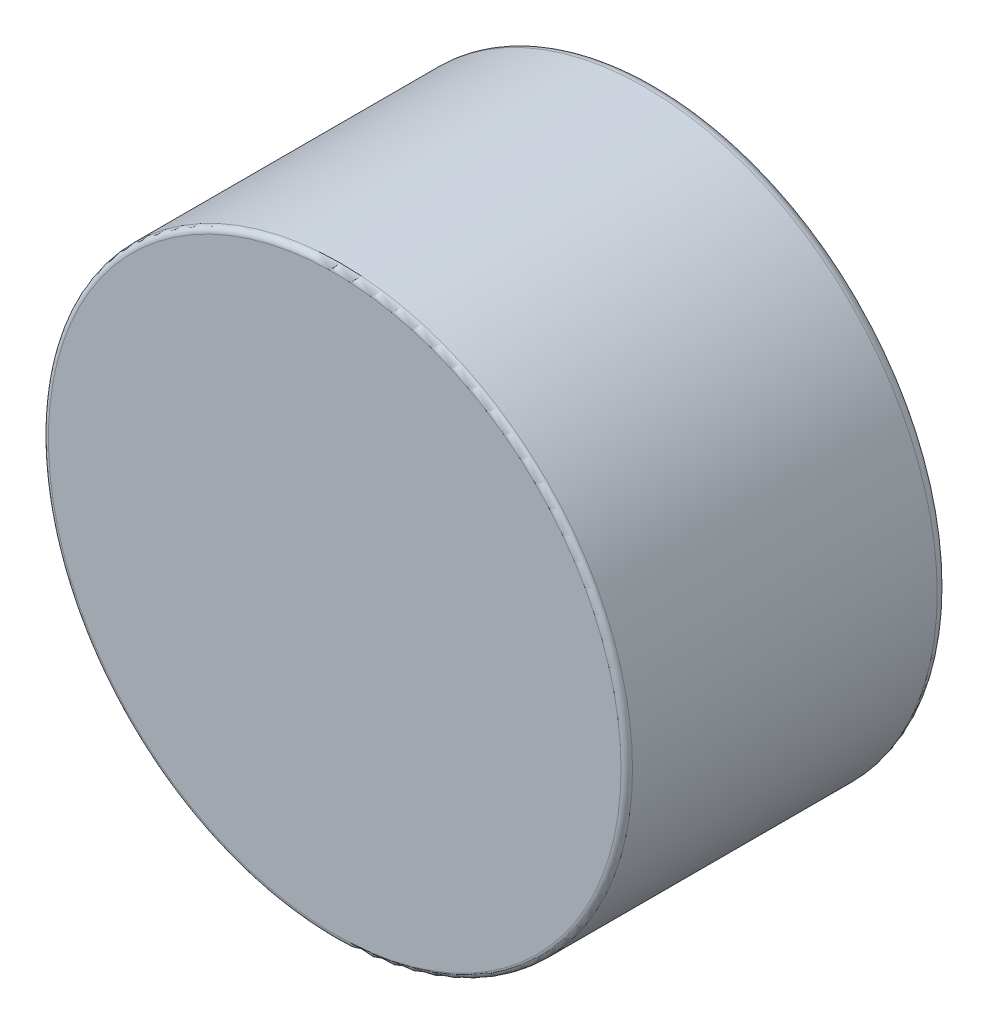
ISO-10303-21;
HEADER;
FILE_DESCRIPTION(('STEP AP214'),'2;1');
FILE_NAME('part.step','',(''),(''),'','','');
FILE_SCHEMA(('AUTOMOTIVE_DESIGN { 1 0 10303 214 1 1 1 1 }'));
ENDSEC;
DATA;
#1=APPLICATION_CONTEXT('core data for automotive mechanical design processes');
#2=APPLICATION_PROTOCOL_DEFINITION('international standard','automotive_design',2000,#1);
#3=PRODUCT_CONTEXT('',#1,'mechanical');
#4=PRODUCT('Part','Part','',(#3));
#5=PRODUCT_RELATED_PRODUCT_CATEGORY('part','',(#4));
#6=PRODUCT_DEFINITION_FORMATION('','',#4);
#7=PRODUCT_DEFINITION_CONTEXT('part definition',#1,'design');
#8=PRODUCT_DEFINITION('design','',#6,#7);
#9=PRODUCT_DEFINITION_SHAPE('','',#8);
#10=(LENGTH_UNIT() NAMED_UNIT(*) SI_UNIT(.MILLI.,.METRE.));
#11=(NAMED_UNIT(*) PLANE_ANGLE_UNIT() SI_UNIT($,.RADIAN.));
#12=(NAMED_UNIT(*) SI_UNIT($,.STERADIAN.) SOLID_ANGLE_UNIT());
#13=UNCERTAINTY_MEASURE_WITH_UNIT(LENGTH_MEASURE(1.E-05),#10,'distance_accuracy_value','');
#14=(GEOMETRIC_REPRESENTATION_CONTEXT(3) GLOBAL_UNCERTAINTY_ASSIGNED_CONTEXT((#13)) GLOBAL_UNIT_ASSIGNED_CONTEXT((#10,
#11,#12)) REPRESENTATION_CONTEXT('',''));
#15=CARTESIAN_POINT('',(0.,0.,0.));
#16=DIRECTION('',(0.,0.,1.));
#17=DIRECTION('',(1.,0.,0.));
#18=AXIS2_PLACEMENT_3D('',#15,#16,#17);
#19=CARTESIAN_POINT('',(0.,0.,28.));
#20=DIRECTION('',(0.,0.,-1.));
#21=DIRECTION('',(-1.,0.,0.));
#22=AXIS2_PLACEMENT_3D('',#19,#20,#21);
#23=CYLINDRICAL_SURFACE('',#22,21.4);
#24=CARTESIAN_POINT('',(0.,0.,2.));
#25=DIRECTION('',(0.,0.,1.));
#26=DIRECTION('',(1.,0.,0.));
#27=AXIS2_PLACEMENT_3D('',#24,#25,#26);
#28=CIRCLE('',#27,21.4);
#29=CARTESIAN_POINT('',(21.4,0.,2.));
#30=VERTEX_POINT('',#29);
#31=EDGE_CURVE('E65',#30,#30,#28,.F.);
#32=ORIENTED_EDGE('',*,*,#31,.T.);
#33=EDGE_LOOP('',(#32));
#34=FACE_BOUND('',#33,.T.);
#35=CARTESIAN_POINT('',(0.,0.,23.));
#36=DIRECTION('',(0.,0.,1.));
#37=DIRECTION('',(1.,0.,0.));
#38=AXIS2_PLACEMENT_3D('',#35,#36,#37);
#39=CIRCLE('',#38,21.4);
#40=CARTESIAN_POINT('',(21.4,0.,23.));
#41=VERTEX_POINT('',#40);
#42=EDGE_CURVE('E73',#41,#41,#39,.T.);
#43=ORIENTED_EDGE('',*,*,#42,.T.);
#44=EDGE_LOOP('',(#43));
#45=FACE_BOUND('',#44,.T.);
#46=ADVANCED_FACE('F41',(#34,#45),#23,.F.);
#47=CARTESIAN_POINT('',(0.,0.,28.));
#48=DIRECTION('',(0.,0.,1.));
#49=DIRECTION('',(1.,0.,0.));
#50=AXIS2_PLACEMENT_3D('',#47,#48,#49);
#51=PLANE('',#50);
#52=CARTESIAN_POINT('',(0.,0.,28.));
#53=DIRECTION('',(0.,0.,1.));
#54=DIRECTION('',(1.,0.,0.));
#55=AXIS2_PLACEMENT_3D('',#52,#53,#54);
#56=CIRCLE('',#55,24.9);
#57=CARTESIAN_POINT('',(24.9,0.,28.));
#58=VERTEX_POINT('',#57);
#59=EDGE_CURVE('E49',#58,#58,#56,.T.);
#60=ORIENTED_EDGE('',*,*,#59,.T.);
#61=EDGE_LOOP('',(#60));
#62=FACE_BOUND('',#61,.T.);
#63=ADVANCED_FACE('F95',(#62),#51,.T.);
#64=CARTESIAN_POINT('',(0.,0.,0.));
#65=DIRECTION('',(0.,0.,1.));
#66=DIRECTION('',(1.,0.,0.));
#67=AXIS2_PLACEMENT_3D('',#64,#65,#66);
#68=PLANE('',#67);
#69=CARTESIAN_POINT('',(0.,0.,0.));
#70=DIRECTION('',(0.,0.,1.));
#71=DIRECTION('',(1.,0.,0.));
#72=AXIS2_PLACEMENT_3D('',#69,#70,#71);
#73=CIRCLE('',#72,24.4);
#74=CARTESIAN_POINT('',(24.4,0.,0.));
#75=VERTEX_POINT('',#74);
#76=EDGE_CURVE('E54',#75,#75,#73,.F.);
#77=ORIENTED_EDGE('',*,*,#76,.T.);
#78=EDGE_LOOP('',(#77));
#79=FACE_BOUND('',#78,.T.);
#80=CARTESIAN_POINT('',(0.,0.,0.));
#81=DIRECTION('',(0.,0.,1.));
#82=DIRECTION('',(1.,0.,0.));
#83=AXIS2_PLACEMENT_3D('',#80,#81,#82);
#84=CIRCLE('',#83,23.4);
#85=CARTESIAN_POINT('',(23.4,0.,0.));
#86=VERTEX_POINT('',#85);
#87=EDGE_CURVE('E69',#86,#86,#84,.T.);
#88=ORIENTED_EDGE('',*,*,#87,.T.);
#89=EDGE_LOOP('',(#88));
#90=FACE_BOUND('',#89,.T.);
#91=ADVANCED_FACE('F91',(#79,#90),#68,.F.);
#92=CARTESIAN_POINT('',(0.,0.,28.));
#93=DIRECTION('',(0.,0.,-1.));
#94=DIRECTION('',(-1.,0.,0.));
#95=AXIS2_PLACEMENT_3D('',#92,#93,#94);
#96=CYLINDRICAL_SURFACE('',#95,25.4);
#97=CARTESIAN_POINT('',(0.,0.,27.5));
#98=DIRECTION('',(0.,0.,1.));
#99=DIRECTION('',(1.,0.,0.));
#100=AXIS2_PLACEMENT_3D('',#97,#98,#99);
#101=CIRCLE('',#100,25.4);
#102=CARTESIAN_POINT('',(25.4,0.,27.5));
#103=VERTEX_POINT('',#102);
#104=EDGE_CURVE('E10',#103,#103,#101,.F.);
#105=ORIENTED_EDGE('',*,*,#104,.T.);
#106=EDGE_LOOP('',(#105));
#107=FACE_BOUND('',#106,.T.);
#108=CARTESIAN_POINT('',(0.,0.,1.));
#109=DIRECTION('',(0.,0.,1.));
#110=DIRECTION('',(1.,0.,0.));
#111=AXIS2_PLACEMENT_3D('',#108,#109,#110);
#112=CIRCLE('',#111,25.4);
#113=CARTESIAN_POINT('',(25.4,0.,1.));
#114=VERTEX_POINT('',#113);
#115=EDGE_CURVE('E59',#114,#114,#112,.T.);
#116=ORIENTED_EDGE('',*,*,#115,.T.);
#117=EDGE_LOOP('',(#116));
#118=FACE_BOUND('',#117,.T.);
#119=ADVANCED_FACE('F82',(#107,#118),#96,.T.);
#120=CARTESIAN_POINT('',(0.,0.,23.));
#121=DIRECTION('',(0.,0.,1.));
#122=DIRECTION('',(1.,0.,0.));
#123=AXIS2_PLACEMENT_3D('',#120,#121,#122);
#124=PLANE('',#123);
#125=ORIENTED_EDGE('',*,*,#42,.F.);
#126=EDGE_LOOP('',(#125));
#127=FACE_BOUND('',#126,.T.);
#128=ADVANCED_FACE('F79',(#127),#124,.F.);
#129=CARTESIAN_POINT('',(0.,0.,2.));
#130=DIRECTION('',(0.,0.,1.));
#131=DIRECTION('',(1.,0.,0.));
#132=AXIS2_PLACEMENT_3D('',#129,#130,#131);
#133=TOROIDAL_SURFACE('',#132,23.4,2.);
#134=ORIENTED_EDGE('',*,*,#31,.F.);
#135=EDGE_LOOP('',(#134));
#136=FACE_BOUND('',#135,.T.);
#137=ORIENTED_EDGE('',*,*,#87,.F.);
#138=EDGE_LOOP('',(#137));
#139=FACE_BOUND('',#138,.T.);
#140=ADVANCED_FACE('F81',(#136,#139),#133,.T.);
#141=CARTESIAN_POINT('',(0.,0.,1.));
#142=DIRECTION('',(0.,0.,1.));
#143=DIRECTION('',(1.,0.,0.));
#144=AXIS2_PLACEMENT_3D('',#141,#142,#143);
#145=TOROIDAL_SURFACE('',#144,24.4,1.);
#146=ORIENTED_EDGE('',*,*,#76,.F.);
#147=EDGE_LOOP('',(#146));
#148=FACE_BOUND('',#147,.T.);
#149=ORIENTED_EDGE('',*,*,#115,.F.);
#150=EDGE_LOOP('',(#149));
#151=FACE_BOUND('',#150,.T.);
#152=ADVANCED_FACE('F88',(#148,#151),#145,.T.);
#153=CARTESIAN_POINT('',(0.,0.,27.5));
#154=DIRECTION('',(0.,0.,1.));
#155=DIRECTION('',(1.,0.,0.));
#156=AXIS2_PLACEMENT_3D('',#153,#154,#155);
#157=TOROIDAL_SURFACE('',#156,24.9,0.5);
#158=ORIENTED_EDGE('',*,*,#104,.F.);
#159=EDGE_LOOP('',(#158));
#160=FACE_BOUND('',#159,.T.);
#161=ORIENTED_EDGE('',*,*,#59,.F.);
#162=EDGE_LOOP('',(#161));
#163=FACE_BOUND('',#162,.T.);
#164=ADVANCED_FACE('F43',(#160,#163),#157,.T.);
#165=CLOSED_SHELL('',(#46,#63,#91,#119,#128,#140,#152,#164));
#166=MANIFOLD_SOLID_BREP('B2',#165);
#167=ADVANCED_BREP_SHAPE_REPRESENTATION('',(#18,#166),#14);
#168=SHAPE_DEFINITION_REPRESENTATION(#9,#167);
ENDSEC;
END-ISO-10303-21;
